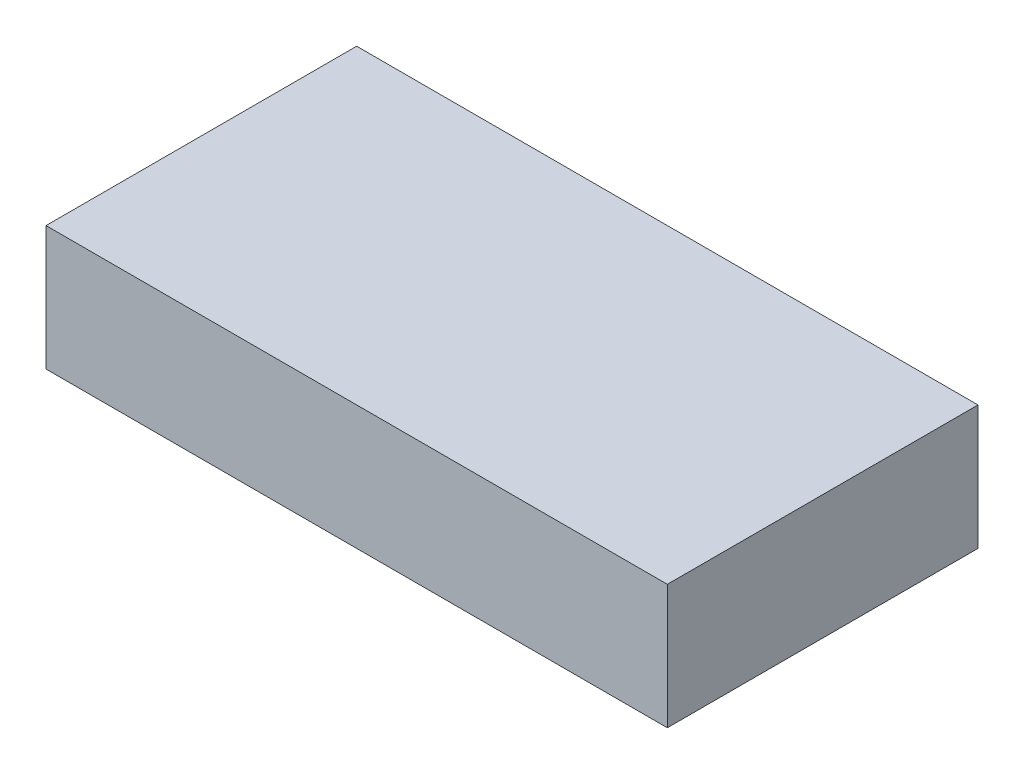
ISO-10303-21;
HEADER;
FILE_DESCRIPTION(('STEP AP214'),'2;1');
FILE_NAME('part.step','',(''),(''),'','','');
FILE_SCHEMA(('AUTOMOTIVE_DESIGN { 1 0 10303 214 1 1 1 1 }'));
ENDSEC;
DATA;
#1=APPLICATION_CONTEXT('core data for automotive mechanical design processes');
#2=APPLICATION_PROTOCOL_DEFINITION('international standard','automotive_design',2000,#1);
#3=PRODUCT_CONTEXT('',#1,'mechanical');
#4=PRODUCT('Part','Part','',(#3));
#5=PRODUCT_RELATED_PRODUCT_CATEGORY('part','',(#4));
#6=PRODUCT_DEFINITION_FORMATION('','',#4);
#7=PRODUCT_DEFINITION_CONTEXT('part definition',#1,'design');
#8=PRODUCT_DEFINITION('design','',#6,#7);
#9=PRODUCT_DEFINITION_SHAPE('','',#8);
#10=(LENGTH_UNIT() NAMED_UNIT(*) SI_UNIT(.MILLI.,.METRE.));
#11=(NAMED_UNIT(*) PLANE_ANGLE_UNIT() SI_UNIT($,.RADIAN.));
#12=(NAMED_UNIT(*) SI_UNIT($,.STERADIAN.) SOLID_ANGLE_UNIT());
#13=UNCERTAINTY_MEASURE_WITH_UNIT(LENGTH_MEASURE(1.E-05),#10,'distance_accuracy_value','');
#14=(GEOMETRIC_REPRESENTATION_CONTEXT(3) GLOBAL_UNCERTAINTY_ASSIGNED_CONTEXT((#13)) GLOBAL_UNIT_ASSIGNED_CONTEXT((#10,
#11,#12)) REPRESENTATION_CONTEXT('',''));
#15=CARTESIAN_POINT('',(0.,0.,0.));
#16=DIRECTION('',(0.,0.,1.));
#17=DIRECTION('',(1.,0.,0.));
#18=AXIS2_PLACEMENT_3D('',#15,#16,#17);
#19=CARTESIAN_POINT('',(-64.9120649862584,40.,29.1306193278496));
#20=DIRECTION('',(1.,0.,0.));
#21=DIRECTION('',(0.,0.,-1.));
#22=AXIS2_PLACEMENT_3D('',#19,#20,#21);
#23=PLANE('',#22);
#24=DIRECTION('',(0.,0.,1.));
#25=VECTOR('',#24,1.);
#26=CARTESIAN_POINT('',(-64.9120649862584,0.,29.1306193278496));
#27=LINE('',#26,#25);
#28=CARTESIAN_POINT('',(-64.9120649862584,0.,-70.8693806721504));
#29=VERTEX_POINT('',#28);
#30=CARTESIAN_POINT('',(-64.9120649862584,0.,29.1306193278496));
#31=VERTEX_POINT('',#30);
#32=EDGE_CURVE('E96',#29,#31,#27,.T.);
#33=ORIENTED_EDGE('',*,*,#32,.T.);
#34=DIRECTION('',(0.,-1.,0.));
#35=VECTOR('',#34,1.);
#36=CARTESIAN_POINT('',(-64.9120649862584,40.,29.1306193278496));
#37=LINE('',#36,#35);
#38=CARTESIAN_POINT('',(-64.9120649862584,40.,29.1306193278496));
#39=VERTEX_POINT('',#38);
#40=EDGE_CURVE('E11',#39,#31,#37,.T.);
#41=ORIENTED_EDGE('',*,*,#40,.F.);
#42=DIRECTION('',(0.,0.,1.));
#43=VECTOR('',#42,1.);
#44=CARTESIAN_POINT('',(-64.9120649862584,40.,29.1306193278496));
#45=LINE('',#44,#43);
#46=CARTESIAN_POINT('',(-64.9120649862584,40.,-70.8693806721504));
#47=VERTEX_POINT('',#46);
#48=EDGE_CURVE('E84',#47,#39,#45,.T.);
#49=ORIENTED_EDGE('',*,*,#48,.F.);
#50=DIRECTION('',(0.,-1.,0.));
#51=VECTOR('',#50,1.);
#52=CARTESIAN_POINT('',(-64.9120649862584,40.,-70.8693806721504));
#53=LINE('',#52,#51);
#54=EDGE_CURVE('E92',#47,#29,#53,.T.);
#55=ORIENTED_EDGE('',*,*,#54,.T.);
#56=EDGE_LOOP('',(#33,#41,#49,#55));
#57=FACE_BOUND('',#56,.T.);
#58=ADVANCED_FACE('F33',(#57),#23,.F.);
#59=CARTESIAN_POINT('',(-64.9120649862584,40.,29.1306193278496));
#60=DIRECTION('',(0.,0.,-1.));
#61=DIRECTION('',(-1.,0.,0.));
#62=AXIS2_PLACEMENT_3D('',#59,#60,#61);
#63=PLANE('',#62);
#64=DIRECTION('',(1.,0.,0.));
#65=VECTOR('',#64,1.);
#66=CARTESIAN_POINT('',(-64.9120649862584,0.,29.1306193278496));
#67=LINE('',#66,#65);
#68=CARTESIAN_POINT('',(135.087935013742,0.,29.1306193278496));
#69=VERTEX_POINT('',#68);
#70=EDGE_CURVE('E88',#31,#69,#67,.T.);
#71=ORIENTED_EDGE('',*,*,#70,.T.);
#72=DIRECTION('',(0.,-1.,0.));
#73=VECTOR('',#72,1.);
#74=CARTESIAN_POINT('',(135.087935013742,40.,29.1306193278496));
#75=LINE('',#74,#73);
#76=CARTESIAN_POINT('',(135.087935013742,40.,29.1306193278496));
#77=VERTEX_POINT('',#76);
#78=EDGE_CURVE('E41',#77,#69,#75,.T.);
#79=ORIENTED_EDGE('',*,*,#78,.F.);
#80=DIRECTION('',(1.,0.,0.));
#81=VECTOR('',#80,1.);
#82=CARTESIAN_POINT('',(-64.9120649862584,40.,29.1306193278496));
#83=LINE('',#82,#81);
#84=EDGE_CURVE('E79',#39,#77,#83,.T.);
#85=ORIENTED_EDGE('',*,*,#84,.F.);
#86=ORIENTED_EDGE('',*,*,#40,.T.);
#87=EDGE_LOOP('',(#71,#79,#85,#86));
#88=FACE_BOUND('',#87,.T.);
#89=ADVANCED_FACE('F87',(#88),#63,.F.);
#90=CARTESIAN_POINT('',(135.087935013742,40.,29.1306193278496));
#91=DIRECTION('',(-1.,0.,0.));
#92=DIRECTION('',(0.,0.,1.));
#93=AXIS2_PLACEMENT_3D('',#90,#91,#92);
#94=PLANE('',#93);
#95=DIRECTION('',(0.,0.,-1.));
#96=VECTOR('',#95,1.);
#97=CARTESIAN_POINT('',(135.087935013742,0.,29.1306193278496));
#98=LINE('',#97,#96);
#99=CARTESIAN_POINT('',(135.087935013742,0.,-70.8693806721504));
#100=VERTEX_POINT('',#99);
#101=EDGE_CURVE('E66',#69,#100,#98,.T.);
#102=ORIENTED_EDGE('',*,*,#101,.T.);
#103=DIRECTION('',(0.,-1.,0.));
#104=VECTOR('',#103,1.);
#105=CARTESIAN_POINT('',(135.087935013742,40.,-70.8693806721504));
#106=LINE('',#105,#104);
#107=CARTESIAN_POINT('',(135.087935013742,40.,-70.8693806721504));
#108=VERTEX_POINT('',#107);
#109=EDGE_CURVE('E89',#108,#100,#106,.T.);
#110=ORIENTED_EDGE('',*,*,#109,.F.);
#111=DIRECTION('',(0.,0.,-1.));
#112=VECTOR('',#111,1.);
#113=CARTESIAN_POINT('',(135.087935013742,40.,29.1306193278496));
#114=LINE('',#113,#112);
#115=EDGE_CURVE('E82',#77,#108,#114,.T.);
#116=ORIENTED_EDGE('',*,*,#115,.F.);
#117=ORIENTED_EDGE('',*,*,#78,.T.);
#118=EDGE_LOOP('',(#102,#110,#116,#117));
#119=FACE_BOUND('',#118,.T.);
#120=ADVANCED_FACE('F90',(#119),#94,.F.);
#121=CARTESIAN_POINT('',(-64.9120649862584,40.,-70.8693806721504));
#122=DIRECTION('',(0.,0.,1.));
#123=DIRECTION('',(1.,0.,0.));
#124=AXIS2_PLACEMENT_3D('',#121,#122,#123);
#125=PLANE('',#124);
#126=DIRECTION('',(-1.,0.,0.));
#127=VECTOR('',#126,1.);
#128=CARTESIAN_POINT('',(-64.9120649862584,0.,-70.8693806721504));
#129=LINE('',#128,#127);
#130=EDGE_CURVE('E72',#100,#29,#129,.T.);
#131=ORIENTED_EDGE('',*,*,#130,.T.);
#132=ORIENTED_EDGE('',*,*,#54,.F.);
#133=DIRECTION('',(-1.,0.,0.));
#134=VECTOR('',#133,1.);
#135=CARTESIAN_POINT('',(-64.9120649862584,40.,-70.8693806721504));
#136=LINE('',#135,#134);
#137=EDGE_CURVE('E49',#108,#47,#136,.T.);
#138=ORIENTED_EDGE('',*,*,#137,.F.);
#139=ORIENTED_EDGE('',*,*,#109,.T.);
#140=EDGE_LOOP('',(#131,#132,#138,#139));
#141=FACE_BOUND('',#140,.T.);
#142=ADVANCED_FACE('F103',(#141),#125,.F.);
#143=CARTESIAN_POINT('',(0.,40.,0.));
#144=DIRECTION('',(0.,-1.,0.));
#145=DIRECTION('',(0.,0.,-1.));
#146=AXIS2_PLACEMENT_3D('',#143,#144,#145);
#147=PLANE('',#146);
#148=ORIENTED_EDGE('',*,*,#48,.T.);
#149=ORIENTED_EDGE('',*,*,#84,.T.);
#150=ORIENTED_EDGE('',*,*,#115,.T.);
#151=ORIENTED_EDGE('',*,*,#137,.T.);
#152=EDGE_LOOP('',(#148,#149,#150,#151));
#153=FACE_BOUND('',#152,.T.);
#154=ADVANCED_FACE('F80',(#153),#147,.F.);
#155=CARTESIAN_POINT('',(0.,0.,0.));
#156=DIRECTION('',(0.,-1.,0.));
#157=DIRECTION('',(0.,0.,-1.));
#158=AXIS2_PLACEMENT_3D('',#155,#156,#157);
#159=PLANE('',#158);
#160=ORIENTED_EDGE('',*,*,#32,.F.);
#161=ORIENTED_EDGE('',*,*,#130,.F.);
#162=ORIENTED_EDGE('',*,*,#101,.F.);
#163=ORIENTED_EDGE('',*,*,#70,.F.);
#164=EDGE_LOOP('',(#160,#161,#162,#163));
#165=FACE_BOUND('',#164,.T.);
#166=ADVANCED_FACE('F106',(#165),#159,.T.);
#167=CLOSED_SHELL('',(#58,#89,#120,#142,#154,#166));
#168=MANIFOLD_SOLID_BREP('B2',#167);
#169=ADVANCED_BREP_SHAPE_REPRESENTATION('',(#18,#168),#14);
#170=SHAPE_DEFINITION_REPRESENTATION(#9,#169);
ENDSEC;
END-ISO-10303-21;
